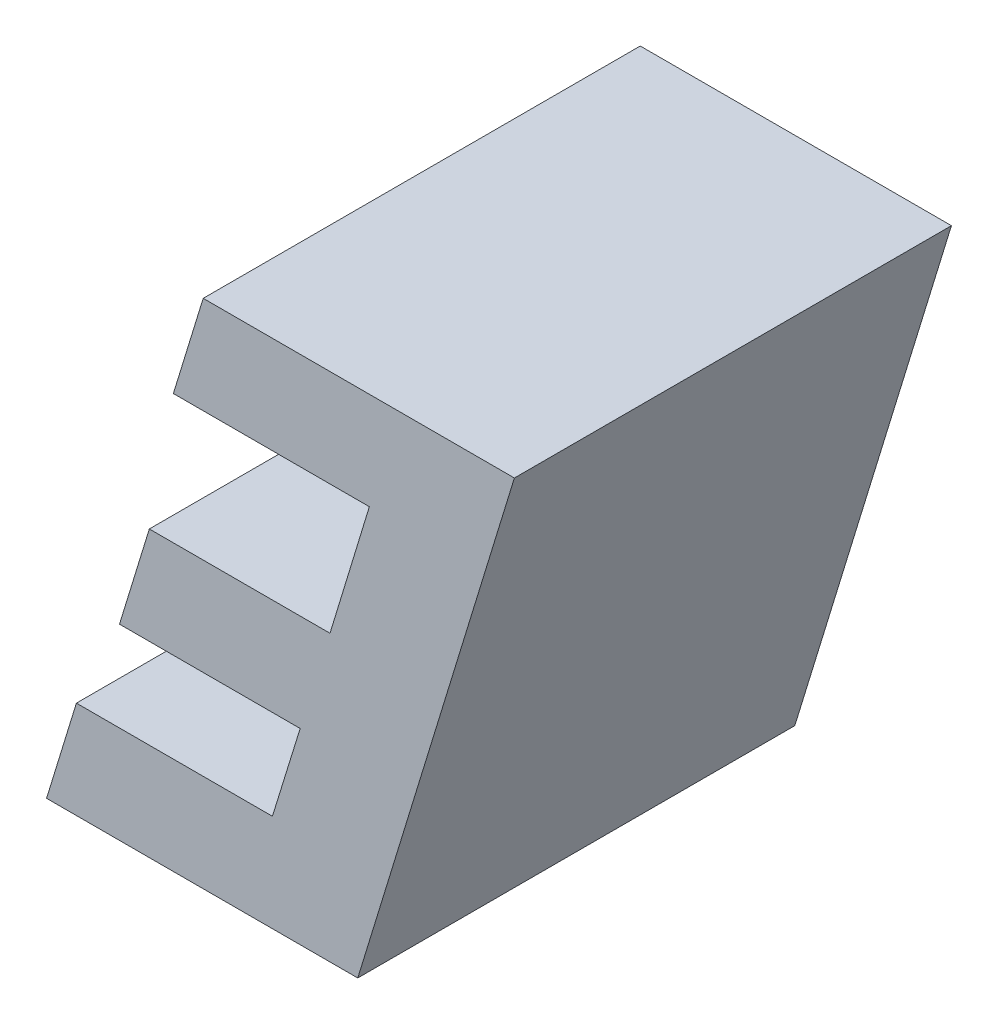
ISO-10303-21;
HEADER;
FILE_DESCRIPTION(('STEP AP214'),'2;1');
FILE_NAME('part.step','',(''),(''),'','','');
FILE_SCHEMA(('AUTOMOTIVE_DESIGN { 1 0 10303 214 1 1 1 1 }'));
ENDSEC;
DATA;
#1=APPLICATION_CONTEXT('core data for automotive mechanical design processes');
#2=APPLICATION_PROTOCOL_DEFINITION('international standard','automotive_design',2000,#1);
#3=PRODUCT_CONTEXT('',#1,'mechanical');
#4=PRODUCT('Part','Part','',(#3));
#5=PRODUCT_RELATED_PRODUCT_CATEGORY('part','',(#4));
#6=PRODUCT_DEFINITION_FORMATION('','',#4);
#7=PRODUCT_DEFINITION_CONTEXT('part definition',#1,'design');
#8=PRODUCT_DEFINITION('design','',#6,#7);
#9=PRODUCT_DEFINITION_SHAPE('','',#8);
#10=(LENGTH_UNIT() NAMED_UNIT(*) SI_UNIT(.MILLI.,.METRE.));
#11=(NAMED_UNIT(*) PLANE_ANGLE_UNIT() SI_UNIT($,.RADIAN.));
#12=(NAMED_UNIT(*) SI_UNIT($,.STERADIAN.) SOLID_ANGLE_UNIT());
#13=UNCERTAINTY_MEASURE_WITH_UNIT(LENGTH_MEASURE(1.E-05),#10,'distance_accuracy_value','');
#14=(GEOMETRIC_REPRESENTATION_CONTEXT(3) GLOBAL_UNCERTAINTY_ASSIGNED_CONTEXT((#13)) GLOBAL_UNIT_ASSIGNED_CONTEXT((#10,
#11,#12)) REPRESENTATION_CONTEXT('',''));
#15=CARTESIAN_POINT('',(0.,0.,0.));
#16=DIRECTION('',(0.,0.,1.));
#17=DIRECTION('',(1.,0.,0.));
#18=AXIS2_PLACEMENT_3D('',#15,#16,#17);
#19=CARTESIAN_POINT('',(5.020802122575,3.535074669142,0.));
#20=DIRECTION('',(-0.956130206843123,0.292942020820038,0.));
#21=DIRECTION('',(-0.292942020820038,-0.956130206843123,0.));
#22=AXIS2_PLACEMENT_3D('',#19,#20,#21);
#23=PLANE('',#22);
#24=DIRECTION('',(-0.292942020813844,-0.95613020684502,0.));
#25=VECTOR('',#24,1.);
#26=CARTESIAN_POINT('',(5.020802122575,3.535074669142,0.1));
#27=LINE('',#26,#25);
#28=CARTESIAN_POINT('',(5.020802122575,3.535074669142,0.1));
#29=VERTEX_POINT('',#28);
#30=CARTESIAN_POINT('',(5.01397554198993,3.51279346862102,0.1));
#31=VERTEX_POINT('',#30);
#32=EDGE_CURVE('E158',#29,#31,#27,.T.);
#33=ORIENTED_EDGE('',*,*,#32,.F.);
#34=DIRECTION('',(0.,0.,1.));
#35=VECTOR('',#34,1.);
#36=CARTESIAN_POINT('',(5.020802122575,3.535074669142,0.));
#37=LINE('',#36,#35);
#38=CARTESIAN_POINT('',(5.020802122575,3.535074669142,0.));
#39=VERTEX_POINT('',#38);
#40=EDGE_CURVE('E111',#39,#29,#37,.T.);
#41=ORIENTED_EDGE('',*,*,#40,.F.);
#42=DIRECTION('',(-0.292942020813844,-0.95613020684502,0.));
#43=VECTOR('',#42,1.);
#44=CARTESIAN_POINT('',(5.020802122575,3.535074669142,0.));
#45=LINE('',#44,#43);
#46=CARTESIAN_POINT('',(5.01397554198993,3.51279346862102,0.));
#47=VERTEX_POINT('',#46);
#48=EDGE_CURVE('E108',#39,#47,#45,.T.);
#49=ORIENTED_EDGE('',*,*,#48,.T.);
#50=DIRECTION('',(0.,0.,-1.));
#51=VECTOR('',#50,1.);
#52=CARTESIAN_POINT('',(5.01397554199,3.512793468621,0.));
#53=LINE('',#52,#51);
#54=EDGE_CURVE('E20',#31,#47,#53,.T.);
#55=ORIENTED_EDGE('',*,*,#54,.F.);
#56=EDGE_LOOP('',(#33,#41,#49,#55));
#57=FACE_BOUND('',#56,.T.);
#58=ADVANCED_FACE('F17',(#57),#23,.T.);
#59=CARTESIAN_POINT('',(5.01397554199,3.512793468621,0.));
#60=DIRECTION('',(0.,-1.,0.));
#61=DIRECTION('',(0.,0.,-1.));
#62=AXIS2_PLACEMENT_3D('',#59,#60,#61);
#63=PLANE('',#62);
#64=DIRECTION('',(1.,0.,0.));
#65=VECTOR('',#64,1.);
#66=CARTESIAN_POINT('',(5.038842599133,3.512793468621,0.1));
#67=LINE('',#66,#65);
#68=CARTESIAN_POINT('',(5.05882238389,3.512793468621,0.1));
#69=VERTEX_POINT('',#68);
#70=EDGE_CURVE('E118',#31,#69,#67,.T.);
#71=ORIENTED_EDGE('',*,*,#70,.F.);
#72=ORIENTED_EDGE('',*,*,#54,.T.);
#73=DIRECTION('',(1.,0.,0.));
#74=VECTOR('',#73,1.);
#75=CARTESIAN_POINT('',(5.038842599133,3.512793468621,0.));
#76=LINE('',#75,#74);
#77=CARTESIAN_POINT('',(5.05882238389,3.512793468621,0.));
#78=VERTEX_POINT('',#77);
#79=EDGE_CURVE('E103',#47,#78,#76,.T.);
#80=ORIENTED_EDGE('',*,*,#79,.T.);
#81=DIRECTION('',(0.,0.,1.));
#82=VECTOR('',#81,1.);
#83=CARTESIAN_POINT('',(5.05882238389,3.512793468621,0.));
#84=LINE('',#83,#82);
#85=EDGE_CURVE('E120',#69,#78,#84,.F.);
#86=ORIENTED_EDGE('',*,*,#85,.F.);
#87=EDGE_LOOP('',(#71,#72,#80,#86));
#88=FACE_BOUND('',#87,.T.);
#89=ADVANCED_FACE('F116',(#88),#63,.T.);
#90=CARTESIAN_POINT('',(5.05882238389,3.512793468621,0.));
#91=DIRECTION('',(-0.956636739424147,0.291283622581045,0.));
#92=DIRECTION('',(-0.291283622581045,-0.956636739424147,0.));
#93=AXIS2_PLACEMENT_3D('',#90,#91,#92);
#94=PLANE('',#93);
#95=DIRECTION('',(-0.291283622594896,-0.95663673941993,0.));
#96=VECTOR('',#95,1.);
#97=CARTESIAN_POINT('',(5.05882238389,3.512793468621,0.1));
#98=LINE('',#97,#96);
#99=CARTESIAN_POINT('',(5.04981509006221,3.48321161941893,0.1));
#100=VERTEX_POINT('',#99);
#101=EDGE_CURVE('E151',#69,#100,#98,.T.);
#102=ORIENTED_EDGE('',*,*,#101,.F.);
#103=ORIENTED_EDGE('',*,*,#85,.T.);
#104=DIRECTION('',(-0.291283622594896,-0.95663673941993,0.));
#105=VECTOR('',#104,1.);
#106=CARTESIAN_POINT('',(5.05882238389,3.512793468621,0.));
#107=LINE('',#106,#105);
#108=CARTESIAN_POINT('',(5.04981509006221,3.48321161941893,0.));
#109=VERTEX_POINT('',#108);
#110=EDGE_CURVE('E125',#78,#109,#107,.T.);
#111=ORIENTED_EDGE('',*,*,#110,.T.);
#112=DIRECTION('',(0.,0.,1.));
#113=VECTOR('',#112,1.);
#114=CARTESIAN_POINT('',(5.049815090062,3.483211619419,0.));
#115=LINE('',#114,#113);
#116=EDGE_CURVE('E145',#100,#109,#115,.F.);
#117=ORIENTED_EDGE('',*,*,#116,.F.);
#118=EDGE_LOOP('',(#102,#103,#111,#117));
#119=FACE_BOUND('',#118,.T.);
#120=ADVANCED_FACE('F149',(#119),#94,.T.);
#121=CARTESIAN_POINT('',(5.049815090062,3.483211619419,0.));
#122=DIRECTION('',(0.,1.,0.));
#123=DIRECTION('',(0.,0.,1.));
#124=AXIS2_PLACEMENT_3D('',#121,#122,#123);
#125=PLANE('',#124);
#126=DIRECTION('',(1.,0.,0.));
#127=VECTOR('',#126,1.);
#128=CARTESIAN_POINT('',(5.038842599133,3.483211619419,0.1));
#129=LINE('',#128,#127);
#130=CARTESIAN_POINT('',(5.008476352074,3.483211619419,0.1));
#131=VERTEX_POINT('',#130);
#132=EDGE_CURVE('E154',#100,#131,#129,.F.);
#133=ORIENTED_EDGE('',*,*,#132,.F.);
#134=ORIENTED_EDGE('',*,*,#116,.T.);
#135=DIRECTION('',(1.,0.,0.));
#136=VECTOR('',#135,1.);
#137=CARTESIAN_POINT('',(5.038842599133,3.483211619419,0.));
#138=LINE('',#137,#136);
#139=CARTESIAN_POINT('',(5.008476352074,3.483211619419,0.));
#140=VERTEX_POINT('',#139);
#141=EDGE_CURVE('E127',#109,#140,#138,.F.);
#142=ORIENTED_EDGE('',*,*,#141,.T.);
#143=DIRECTION('',(0.,0.,1.));
#144=VECTOR('',#143,1.);
#145=CARTESIAN_POINT('',(5.008476352074,3.483211619419,0.));
#146=LINE('',#145,#144);
#147=EDGE_CURVE('E142',#131,#140,#146,.F.);
#148=ORIENTED_EDGE('',*,*,#147,.F.);
#149=EDGE_LOOP('',(#133,#134,#142,#148));
#150=FACE_BOUND('',#149,.T.);
#151=ADVANCED_FACE('F178',(#150),#125,.T.);
#152=CARTESIAN_POINT('',(5.008476352074,3.483211619419,0.));
#153=DIRECTION('',(-0.956130206843123,0.292942020820038,0.));
#154=DIRECTION('',(-0.292942020820038,-0.956130206843123,0.));
#155=AXIS2_PLACEMENT_3D('',#152,#153,#154);
#156=PLANE('',#155);
#157=DIRECTION('',(-0.292942020813844,-0.95613020684502,0.));
#158=VECTOR('',#157,1.);
#159=CARTESIAN_POINT('',(5.008476352074,3.483211619419,0.1));
#160=LINE('',#159,#158);
#161=CARTESIAN_POINT('',(5.00164977148893,3.46093041889802,0.1));
#162=VERTEX_POINT('',#161);
#163=EDGE_CURVE('E184',#131,#162,#160,.T.);
#164=ORIENTED_EDGE('',*,*,#163,.F.);
#165=ORIENTED_EDGE('',*,*,#147,.T.);
#166=DIRECTION('',(-0.292942020813844,-0.95613020684502,0.));
#167=VECTOR('',#166,1.);
#168=CARTESIAN_POINT('',(5.008476352074,3.483211619419,0.));
#169=LINE('',#168,#167);
#170=CARTESIAN_POINT('',(5.00164977148893,3.46093041889802,0.));
#171=VERTEX_POINT('',#170);
#172=EDGE_CURVE('E176',#140,#171,#169,.T.);
#173=ORIENTED_EDGE('',*,*,#172,.T.);
#174=DIRECTION('',(0.,0.,-1.));
#175=VECTOR('',#174,1.);
#176=CARTESIAN_POINT('',(5.001649771489,3.460930418898,0.));
#177=LINE('',#176,#175);
#178=EDGE_CURVE('E139',#162,#171,#177,.T.);
#179=ORIENTED_EDGE('',*,*,#178,.F.);
#180=EDGE_LOOP('',(#164,#165,#173,#179));
#181=FACE_BOUND('',#180,.T.);
#182=ADVANCED_FACE('F182',(#181),#156,.T.);
#183=CARTESIAN_POINT('',(5.001649771489,3.460930418898,0.));
#184=DIRECTION('',(0.,-1.,0.));
#185=DIRECTION('',(0.,0.,-1.));
#186=AXIS2_PLACEMENT_3D('',#183,#184,#185);
#187=PLANE('',#186);
#188=DIRECTION('',(1.,0.,0.));
#189=VECTOR('',#188,1.);
#190=CARTESIAN_POINT('',(5.038842599133,3.460930418898,0.1));
#191=LINE('',#190,#189);
#192=CARTESIAN_POINT('',(5.042988509477,3.460930418898,0.1));
#193=VERTEX_POINT('',#192);
#194=EDGE_CURVE('E200',#162,#193,#191,.T.);
#195=ORIENTED_EDGE('',*,*,#194,.F.);
#196=ORIENTED_EDGE('',*,*,#178,.T.);
#197=DIRECTION('',(1.,0.,0.));
#198=VECTOR('',#197,1.);
#199=CARTESIAN_POINT('',(5.038842599133,3.460930418898,0.));
#200=LINE('',#199,#198);
#201=CARTESIAN_POINT('',(5.042988509477,3.460930418898,0.));
#202=VERTEX_POINT('',#201);
#203=EDGE_CURVE('E174',#171,#202,#200,.T.);
#204=ORIENTED_EDGE('',*,*,#203,.T.);
#205=DIRECTION('',(0.,0.,1.));
#206=VECTOR('',#205,1.);
#207=CARTESIAN_POINT('',(5.042988509477,3.460930418898,0.));
#208=LINE('',#207,#206);
#209=EDGE_CURVE('E136',#193,#202,#208,.F.);
#210=ORIENTED_EDGE('',*,*,#209,.F.);
#211=EDGE_LOOP('',(#195,#196,#204,#210));
#212=FACE_BOUND('',#211,.T.);
#213=ADVANCED_FACE('F190',(#212),#187,.T.);
#214=CARTESIAN_POINT('',(5.042988509477,3.460930418898,0.));
#215=DIRECTION('',(-0.955492945435694,0.295013950894906,0.));
#216=DIRECTION('',(-0.295013950894906,-0.955492945435694,0.));
#217=AXIS2_PLACEMENT_3D('',#214,#215,#216);
#218=PLANE('',#217);
#219=DIRECTION('',(-0.295013950892559,-0.955492945436418,0.));
#220=VECTOR('',#219,1.);
#221=CARTESIAN_POINT('',(5.042988509477,3.460930418898,0.1));
#222=LINE('',#221,#220);
#223=CARTESIAN_POINT('',(5.03663599698798,3.44035586352301,0.1));
#224=VERTEX_POINT('',#223);
#225=EDGE_CURVE('E195',#193,#224,#222,.T.);
#226=ORIENTED_EDGE('',*,*,#225,.F.);
#227=ORIENTED_EDGE('',*,*,#209,.T.);
#228=DIRECTION('',(-0.295013950892559,-0.955492945436418,0.));
#229=VECTOR('',#228,1.);
#230=CARTESIAN_POINT('',(5.042988509477,3.460930418898,0.));
#231=LINE('',#230,#229);
#232=CARTESIAN_POINT('',(5.03663599698798,3.44035586352301,0.));
#233=VERTEX_POINT('',#232);
#234=EDGE_CURVE('E172',#202,#233,#231,.T.);
#235=ORIENTED_EDGE('',*,*,#234,.T.);
#236=DIRECTION('',(0.,0.,1.));
#237=VECTOR('',#236,1.);
#238=CARTESIAN_POINT('',(5.036635996988,3.440355863523,0.));
#239=LINE('',#238,#237);
#240=EDGE_CURVE('E133',#224,#233,#239,.F.);
#241=ORIENTED_EDGE('',*,*,#240,.F.);
#242=EDGE_LOOP('',(#226,#227,#235,#241));
#243=FACE_BOUND('',#242,.T.);
#244=ADVANCED_FACE('F193',(#243),#218,.T.);
#245=CARTESIAN_POINT('',(5.036635996988,3.440355863523,0.));
#246=DIRECTION('',(0.,1.,0.));
#247=DIRECTION('',(0.,0.,1.));
#248=AXIS2_PLACEMENT_3D('',#245,#246,#247);
#249=PLANE('',#248);
#250=DIRECTION('',(1.,0.,0.));
#251=VECTOR('',#250,1.);
#252=CARTESIAN_POINT('',(5.038842599133,3.440355863523,0.1));
#253=LINE('',#252,#251);
#254=CARTESIAN_POINT('',(4.991789155089,3.440355863523,0.1));
#255=VERTEX_POINT('',#254);
#256=EDGE_CURVE('E199',#224,#255,#253,.F.);
#257=ORIENTED_EDGE('',*,*,#256,.F.);
#258=ORIENTED_EDGE('',*,*,#240,.T.);
#259=DIRECTION('',(1.,0.,0.));
#260=VECTOR('',#259,1.);
#261=CARTESIAN_POINT('',(5.038842599133,3.440355863523,0.));
#262=LINE('',#261,#260);
#263=CARTESIAN_POINT('',(4.991789155089,3.440355863523,0.));
#264=VERTEX_POINT('',#263);
#265=EDGE_CURVE('E170',#233,#264,#262,.F.);
#266=ORIENTED_EDGE('',*,*,#265,.T.);
#267=DIRECTION('',(0.,0.,1.));
#268=VECTOR('',#267,1.);
#269=CARTESIAN_POINT('',(4.991789155089,3.440355863523,0.));
#270=LINE('',#269,#268);
#271=EDGE_CURVE('E114',#255,#264,#270,.F.);
#272=ORIENTED_EDGE('',*,*,#271,.F.);
#273=EDGE_LOOP('',(#257,#258,#266,#272));
#274=FACE_BOUND('',#273,.T.);
#275=ADVANCED_FACE('F235',(#274),#249,.T.);
#276=CARTESIAN_POINT('',(4.991789155089,3.440355863523,0.));
#277=DIRECTION('',(-0.956130206843123,0.292942020820038,0.));
#278=DIRECTION('',(-0.292942020820038,-0.956130206843123,0.));
#279=AXIS2_PLACEMENT_3D('',#276,#277,#278);
#280=PLANE('',#279);
#281=DIRECTION('',(-0.292942020813839,-0.956130206845022,0.));
#282=VECTOR('',#281,1.);
#283=CARTESIAN_POINT('',(4.991789155089,3.440355863523,0.1));
#284=LINE('',#283,#282);
#285=CARTESIAN_POINT('',(4.98496257450396,3.41807466300201,0.1));
#286=VERTEX_POINT('',#285);
#287=EDGE_CURVE('E206',#255,#286,#284,.T.);
#288=ORIENTED_EDGE('',*,*,#287,.F.);
#289=ORIENTED_EDGE('',*,*,#271,.T.);
#290=DIRECTION('',(-0.292942020813839,-0.956130206845022,0.));
#291=VECTOR('',#290,1.);
#292=CARTESIAN_POINT('',(4.991789155089,3.440355863523,0.));
#293=LINE('',#292,#291);
#294=CARTESIAN_POINT('',(4.98496257450396,3.41807466300201,0.));
#295=VERTEX_POINT('',#294);
#296=EDGE_CURVE('E168',#264,#295,#293,.T.);
#297=ORIENTED_EDGE('',*,*,#296,.T.);
#298=DIRECTION('',(0.,0.,-1.));
#299=VECTOR('',#298,1.);
#300=CARTESIAN_POINT('',(4.984962574504,3.418074663002,0.));
#301=LINE('',#300,#299);
#302=EDGE_CURVE('E212',#286,#295,#301,.T.);
#303=ORIENTED_EDGE('',*,*,#302,.F.);
#304=EDGE_LOOP('',(#288,#289,#297,#303));
#305=FACE_BOUND('',#304,.T.);
#306=ADVANCED_FACE('F233',(#305),#280,.T.);
#307=CARTESIAN_POINT('',(5.038842599133,3.475907884522,0.));
#308=DIRECTION('',(0.,0.,1.));
#309=DIRECTION('',(1.,0.,0.));
#310=AXIS2_PLACEMENT_3D('',#307,#308,#309);
#311=PLANE('',#310);
#312=DIRECTION('',(1.,0.,0.));
#313=VECTOR('',#312,1.);
#314=CARTESIAN_POINT('',(4.984962574504,3.418074663002,0.));
#315=LINE('',#314,#313);
#316=CARTESIAN_POINT('',(5.056167602551,3.418074663002,0.));
#317=VERTEX_POINT('',#316);
#318=EDGE_CURVE('E208',#295,#317,#315,.T.);
#319=ORIENTED_EDGE('',*,*,#318,.F.);
#320=ORIENTED_EDGE('',*,*,#296,.F.);
#321=ORIENTED_EDGE('',*,*,#265,.F.);
#322=ORIENTED_EDGE('',*,*,#234,.F.);
#323=ORIENTED_EDGE('',*,*,#203,.F.);
#324=ORIENTED_EDGE('',*,*,#172,.F.);
#325=ORIENTED_EDGE('',*,*,#141,.F.);
#326=ORIENTED_EDGE('',*,*,#110,.F.);
#327=ORIENTED_EDGE('',*,*,#79,.F.);
#328=ORIENTED_EDGE('',*,*,#48,.F.);
#329=DIRECTION('',(1.,0.,0.));
#330=VECTOR('',#329,1.);
#331=CARTESIAN_POINT('',(5.092007150623,3.535074669142,0.));
#332=LINE('',#331,#330);
#333=CARTESIAN_POINT('',(5.09200715062301,3.535074669142,0.));
#334=VERTEX_POINT('',#333);
#335=EDGE_CURVE('E166',#334,#39,#332,.F.);
#336=ORIENTED_EDGE('',*,*,#335,.F.);
#337=DIRECTION('',(0.292887764301041,0.956146828433132,0.));
#338=VECTOR('',#337,1.);
#339=CARTESIAN_POINT('',(5.056167602551,3.418074663002,0.));
#340=LINE('',#339,#338);
#341=EDGE_CURVE('E215',#317,#334,#340,.T.);
#342=ORIENTED_EDGE('',*,*,#341,.F.);
#343=EDGE_LOOP('',(#319,#320,#321,#322,#323,#324,#325,#326,#327,#328,#336,#342));
#344=FACE_BOUND('',#343,.T.);
#345=ADVANCED_FACE('F123',(#344),#311,.F.);
#346=CARTESIAN_POINT('',(5.092007150623,3.535074669142,0.));
#347=DIRECTION('',(0.,1.,0.));
#348=DIRECTION('',(0.,0.,1.));
#349=AXIS2_PLACEMENT_3D('',#346,#347,#348);
#350=PLANE('',#349);
#351=DIRECTION('',(1.,0.,0.));
#352=VECTOR('',#351,1.);
#353=CARTESIAN_POINT('',(5.038842599133,3.535074669142,0.1));
#354=LINE('',#353,#352);
#355=CARTESIAN_POINT('',(5.09200715062301,3.535074669142,0.1));
#356=VERTEX_POINT('',#355);
#357=EDGE_CURVE('E160',#356,#29,#354,.F.);
#358=ORIENTED_EDGE('',*,*,#357,.F.);
#359=DIRECTION('',(0.,0.,1.));
#360=VECTOR('',#359,1.);
#361=CARTESIAN_POINT('',(5.09200715062303,3.53507466914199,0.));
#362=LINE('',#361,#360);
#363=EDGE_CURVE('E218',#334,#356,#362,.T.);
#364=ORIENTED_EDGE('',*,*,#363,.F.);
#365=ORIENTED_EDGE('',*,*,#335,.T.);
#366=ORIENTED_EDGE('',*,*,#40,.T.);
#367=EDGE_LOOP('',(#358,#364,#365,#366));
#368=FACE_BOUND('',#367,.T.);
#369=ADVANCED_FACE('F226',(#368),#350,.T.);
#370=CARTESIAN_POINT('',(5.038842599133,3.475907884522,0.1));
#371=DIRECTION('',(0.,0.,1.));
#372=DIRECTION('',(1.,0.,0.));
#373=AXIS2_PLACEMENT_3D('',#370,#371,#372);
#374=PLANE('',#373);
#375=ORIENTED_EDGE('',*,*,#287,.T.);
#376=DIRECTION('',(1.,0.,0.));
#377=VECTOR('',#376,1.);
#378=CARTESIAN_POINT('',(4.984962574504,3.418074663002,0.1));
#379=LINE('',#378,#377);
#380=CARTESIAN_POINT('',(5.056167602551,3.418074663002,0.1));
#381=VERTEX_POINT('',#380);
#382=EDGE_CURVE('E35',#381,#286,#379,.F.);
#383=ORIENTED_EDGE('',*,*,#382,.F.);
#384=DIRECTION('',(0.292887764301041,0.956146828433132,0.));
#385=VECTOR('',#384,1.);
#386=CARTESIAN_POINT('',(5.056167602551,3.418074663002,0.1));
#387=LINE('',#386,#385);
#388=EDGE_CURVE('E26',#356,#381,#387,.F.);
#389=ORIENTED_EDGE('',*,*,#388,.F.);
#390=ORIENTED_EDGE('',*,*,#357,.T.);
#391=ORIENTED_EDGE('',*,*,#32,.T.);
#392=ORIENTED_EDGE('',*,*,#70,.T.);
#393=ORIENTED_EDGE('',*,*,#101,.T.);
#394=ORIENTED_EDGE('',*,*,#132,.T.);
#395=ORIENTED_EDGE('',*,*,#163,.T.);
#396=ORIENTED_EDGE('',*,*,#194,.T.);
#397=ORIENTED_EDGE('',*,*,#225,.T.);
#398=ORIENTED_EDGE('',*,*,#256,.T.);
#399=EDGE_LOOP('',(#375,#383,#389,#390,#391,#392,#393,#394,#395,#396,#397,#398));
#400=FACE_BOUND('',#399,.T.);
#401=ADVANCED_FACE('F156',(#400),#374,.T.);
#402=CARTESIAN_POINT('',(4.984962574504,3.418074663002,0.));
#403=DIRECTION('',(0.,-1.,0.));
#404=DIRECTION('',(0.,0.,-1.));
#405=AXIS2_PLACEMENT_3D('',#402,#403,#404);
#406=PLANE('',#405);
#407=ORIENTED_EDGE('',*,*,#382,.T.);
#408=ORIENTED_EDGE('',*,*,#302,.T.);
#409=ORIENTED_EDGE('',*,*,#318,.T.);
#410=DIRECTION('',(0.,0.,1.));
#411=VECTOR('',#410,1.);
#412=CARTESIAN_POINT('',(5.056167602551,3.418074663002,0.));
#413=LINE('',#412,#411);
#414=EDGE_CURVE('E11',#381,#317,#413,.F.);
#415=ORIENTED_EDGE('',*,*,#414,.F.);
#416=EDGE_LOOP('',(#407,#408,#409,#415));
#417=FACE_BOUND('',#416,.T.);
#418=ADVANCED_FACE('F229',(#417),#406,.T.);
#419=CARTESIAN_POINT('',(5.056167602551,3.418074663002,0.));
#420=DIRECTION('',(0.956146828433132,-0.292887764301041,0.));
#421=DIRECTION('',(0.292887764301041,0.956146828433132,0.));
#422=AXIS2_PLACEMENT_3D('',#419,#420,#421);
#423=PLANE('',#422);
#424=ORIENTED_EDGE('',*,*,#388,.T.);
#425=ORIENTED_EDGE('',*,*,#414,.T.);
#426=ORIENTED_EDGE('',*,*,#341,.T.);
#427=ORIENTED_EDGE('',*,*,#363,.T.);
#428=EDGE_LOOP('',(#424,#425,#426,#427));
#429=FACE_BOUND('',#428,.T.);
#430=ADVANCED_FACE('F223',(#429),#423,.T.);
#431=CLOSED_SHELL('',(#58,#89,#120,#151,#182,#213,#244,#275,#306,#345,#369,#401,#418,#430));
#432=MANIFOLD_SOLID_BREP('B1',#431);
#433=ADVANCED_BREP_SHAPE_REPRESENTATION('',(#18,#432),#14);
#434=SHAPE_DEFINITION_REPRESENTATION(#9,#433);
ENDSEC;
END-ISO-10303-21;
